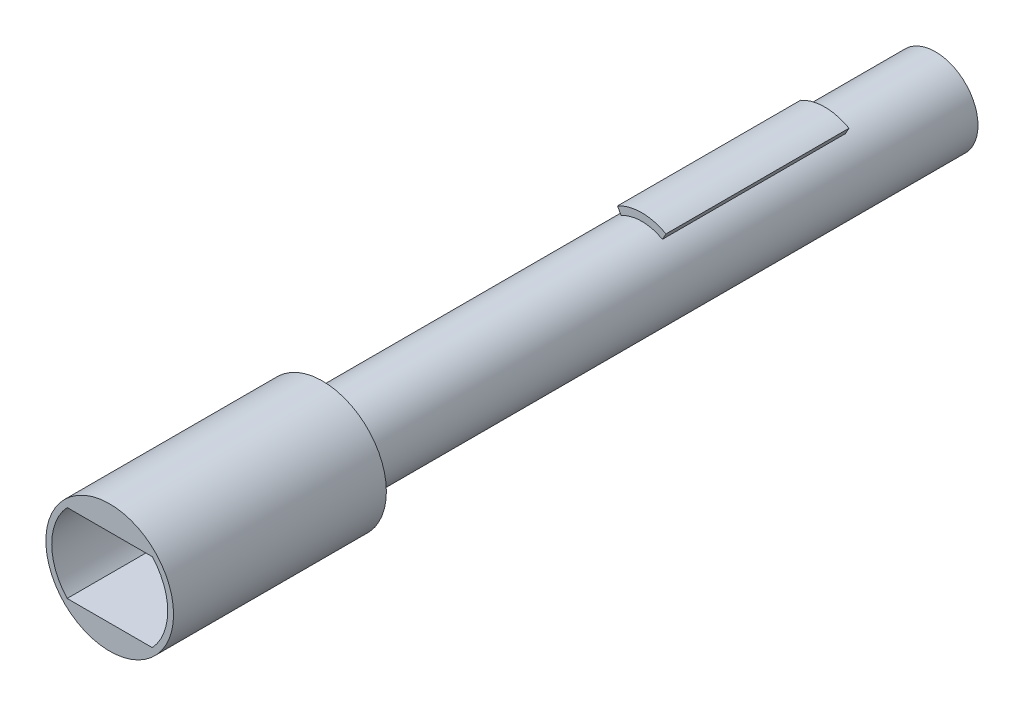
ISO-10303-21;
HEADER;
FILE_DESCRIPTION(('STEP AP214'),'2;1');
FILE_NAME('part.step','',(''),(''),'','','');
FILE_SCHEMA(('AUTOMOTIVE_DESIGN { 1 0 10303 214 1 1 1 1 }'));
ENDSEC;
DATA;
#1=APPLICATION_CONTEXT('core data for automotive mechanical design processes');
#2=APPLICATION_PROTOCOL_DEFINITION('international standard','automotive_design',2000,#1);
#3=PRODUCT_CONTEXT('',#1,'mechanical');
#4=PRODUCT('Part','Part','',(#3));
#5=PRODUCT_RELATED_PRODUCT_CATEGORY('part','',(#4));
#6=PRODUCT_DEFINITION_FORMATION('','',#4);
#7=PRODUCT_DEFINITION_CONTEXT('part definition',#1,'design');
#8=PRODUCT_DEFINITION('design','',#6,#7);
#9=PRODUCT_DEFINITION_SHAPE('','',#8);
#10=(LENGTH_UNIT() NAMED_UNIT(*) SI_UNIT(.MILLI.,.METRE.));
#11=(NAMED_UNIT(*) PLANE_ANGLE_UNIT() SI_UNIT($,.RADIAN.));
#12=(NAMED_UNIT(*) SI_UNIT($,.STERADIAN.) SOLID_ANGLE_UNIT());
#13=UNCERTAINTY_MEASURE_WITH_UNIT(LENGTH_MEASURE(1.E-05),#10,'distance_accuracy_value','');
#14=(GEOMETRIC_REPRESENTATION_CONTEXT(3) GLOBAL_UNCERTAINTY_ASSIGNED_CONTEXT((#13)) GLOBAL_UNIT_ASSIGNED_CONTEXT((#10,
#11,#12)) REPRESENTATION_CONTEXT('',''));
#15=CARTESIAN_POINT('',(0.,0.,0.));
#16=DIRECTION('',(0.,0.,1.));
#17=DIRECTION('',(1.,0.,0.));
#18=AXIS2_PLACEMENT_3D('',#15,#16,#17);
#19=CARTESIAN_POINT('',(0.,0.,5.2));
#20=DIRECTION('',(0.,0.,-1.));
#21=DIRECTION('',(-1.,0.,0.));
#22=AXIS2_PLACEMENT_3D('',#19,#20,#21);
#23=CYLINDRICAL_SURFACE('',#22,2.);
#24=CARTESIAN_POINT('',(0.,0.,5.2));
#25=DIRECTION('',(0.,0.,1.));
#26=DIRECTION('',(1.,0.,0.));
#27=AXIS2_PLACEMENT_3D('',#24,#25,#26);
#28=CIRCLE('',#27,2.);
#29=CARTESIAN_POINT('',(0.969619240492676,1.74923941427879,5.2));
#30=VERTEX_POINT('',#29);
#31=CARTESIAN_POINT('',(-0.969619240492676,1.74923941427879,5.2));
#32=VERTEX_POINT('',#31);
#33=EDGE_CURVE('E12',#30,#32,#28,.T.);
#34=ORIENTED_EDGE('',*,*,#33,.F.);
#35=DIRECTION('',(0.,0.,-1.));
#36=VECTOR('',#35,1.);
#37=CARTESIAN_POINT('',(0.969619240492676,1.74923941427879,13.8));
#38=LINE('',#37,#36);
#39=CARTESIAN_POINT('',(0.969619240492676,1.74923941427879,13.8));
#40=VERTEX_POINT('',#39);
#41=EDGE_CURVE('E204',#40,#30,#38,.T.);
#42=ORIENTED_EDGE('',*,*,#41,.F.);
#43=CARTESIAN_POINT('',(0.,0.,13.8));
#44=DIRECTION('',(0.,0.,1.));
#45=DIRECTION('',(1.,0.,0.));
#46=AXIS2_PLACEMENT_3D('',#43,#44,#45);
#47=CIRCLE('',#46,2.);
#48=CARTESIAN_POINT('',(-0.969619240492676,1.74923941427879,13.8));
#49=VERTEX_POINT('',#48);
#50=EDGE_CURVE('E184',#40,#49,#47,.T.);
#51=ORIENTED_EDGE('',*,*,#50,.T.);
#52=DIRECTION('',(0.,0.,-1.));
#53=VECTOR('',#52,1.);
#54=CARTESIAN_POINT('',(-0.969619240492676,1.74923941427879,13.8));
#55=LINE('',#54,#53);
#56=EDGE_CURVE('E215',#49,#32,#55,.T.);
#57=ORIENTED_EDGE('',*,*,#56,.T.);
#58=EDGE_LOOP('',(#34,#42,#51,#57));
#59=FACE_BOUND('',#58,.T.);
#60=CARTESIAN_POINT('',(0.,0.,0.));
#61=DIRECTION('',(0.,0.,1.));
#62=DIRECTION('',(1.,0.,0.));
#63=AXIS2_PLACEMENT_3D('',#60,#61,#62);
#64=CIRCLE('',#63,2.);
#65=CARTESIAN_POINT('',(2.,0.,0.));
#66=VERTEX_POINT('',#65);
#67=EDGE_CURVE('E68',#66,#66,#64,.T.);
#68=ORIENTED_EDGE('',*,*,#67,.T.);
#69=EDGE_LOOP('',(#68));
#70=FACE_BOUND('',#69,.T.);
#71=CARTESIAN_POINT('',(0.,0.,28.8));
#72=DIRECTION('',(0.,0.,1.));
#73=DIRECTION('',(1.,0.,0.));
#74=AXIS2_PLACEMENT_3D('',#71,#72,#73);
#75=CIRCLE('',#74,2.);
#76=CARTESIAN_POINT('',(2.,0.,28.8));
#77=VERTEX_POINT('',#76);
#78=EDGE_CURVE('E188',#77,#77,#75,.T.);
#79=ORIENTED_EDGE('',*,*,#78,.F.);
#80=EDGE_LOOP('',(#79));
#81=FACE_BOUND('',#80,.T.);
#82=ADVANCED_FACE('F65',(#59,#70,#81),#23,.T.);
#83=CARTESIAN_POINT('',(0.,0.,0.));
#84=DIRECTION('',(0.,0.,1.));
#85=DIRECTION('',(1.,0.,0.));
#86=AXIS2_PLACEMENT_3D('',#83,#84,#85);
#87=PLANE('',#86);
#88=ORIENTED_EDGE('',*,*,#67,.F.);
#89=EDGE_LOOP('',(#88));
#90=FACE_BOUND('',#89,.T.);
#91=ADVANCED_FACE('F248',(#90),#87,.F.);
#92=CARTESIAN_POINT('',(0.,0.,5.2));
#93=DIRECTION('',(0.,0.,1.));
#94=DIRECTION('',(1.,0.,0.));
#95=AXIS2_PLACEMENT_3D('',#92,#93,#94);
#96=PLANE('',#95);
#97=DIRECTION('',(0.484809620246338,0.874619707139395,0.));
#98=VECTOR('',#97,1.);
#99=CARTESIAN_POINT('',(0.,0.,5.2));
#100=LINE('',#99,#98);
#101=CARTESIAN_POINT('',(1.13930260757889,2.05535631177758,5.2));
#102=VERTEX_POINT('',#101);
#103=EDGE_CURVE('E192',#30,#102,#100,.T.);
#104=ORIENTED_EDGE('',*,*,#103,.F.);
#105=ORIENTED_EDGE('',*,*,#33,.T.);
#106=DIRECTION('',(-0.484809620246338,0.874619707139395,0.));
#107=VECTOR('',#106,1.);
#108=CARTESIAN_POINT('',(0.,0.,5.2));
#109=LINE('',#108,#107);
#110=CARTESIAN_POINT('',(-1.13930260757889,2.05535631177758,5.2));
#111=VERTEX_POINT('',#110);
#112=EDGE_CURVE('E200',#32,#111,#109,.T.);
#113=ORIENTED_EDGE('',*,*,#112,.T.);
#114=CARTESIAN_POINT('',(0.,0.,5.2));
#115=DIRECTION('',(0.,0.,1.));
#116=DIRECTION('',(1.,0.,0.));
#117=AXIS2_PLACEMENT_3D('',#114,#115,#116);
#118=CIRCLE('',#117,2.35);
#119=EDGE_CURVE('E205',#102,#111,#118,.T.);
#120=ORIENTED_EDGE('',*,*,#119,.F.);
#121=EDGE_LOOP('',(#104,#105,#113,#120));
#122=FACE_BOUND('',#121,.T.);
#123=ADVANCED_FACE('F237',(#122),#96,.F.);
#124=CARTESIAN_POINT('',(0.,0.,13.8));
#125=DIRECTION('',(-0.874619707139395,-0.484809620246338,0.));
#126=DIRECTION('',(0.484809620246338,-0.874619707139395,0.));
#127=AXIS2_PLACEMENT_3D('',#124,#125,#126);
#128=PLANE('',#127);
#129=ORIENTED_EDGE('',*,*,#112,.F.);
#130=ORIENTED_EDGE('',*,*,#56,.F.);
#131=DIRECTION('',(-0.484809620246338,0.874619707139395,0.));
#132=VECTOR('',#131,1.);
#133=CARTESIAN_POINT('',(0.,0.,13.8));
#134=LINE('',#133,#132);
#135=CARTESIAN_POINT('',(-1.13930260757889,2.05535631177758,13.8));
#136=VERTEX_POINT('',#135);
#137=EDGE_CURVE('E199',#49,#136,#134,.T.);
#138=ORIENTED_EDGE('',*,*,#137,.T.);
#139=DIRECTION('',(0.,0.,-1.));
#140=VECTOR('',#139,1.);
#141=CARTESIAN_POINT('',(-1.13930260757889,2.05535631177758,13.8));
#142=LINE('',#141,#140);
#143=EDGE_CURVE('E218',#136,#111,#142,.T.);
#144=ORIENTED_EDGE('',*,*,#143,.T.);
#145=EDGE_LOOP('',(#129,#130,#138,#144));
#146=FACE_BOUND('',#145,.T.);
#147=ADVANCED_FACE('F240',(#146),#128,.T.);
#148=CARTESIAN_POINT('',(0.,0.,13.8));
#149=DIRECTION('',(0.,0.,-1.));
#150=DIRECTION('',(-1.,0.,0.));
#151=AXIS2_PLACEMENT_3D('',#148,#149,#150);
#152=CYLINDRICAL_SURFACE('',#151,2.35);
#153=ORIENTED_EDGE('',*,*,#119,.T.);
#154=ORIENTED_EDGE('',*,*,#143,.F.);
#155=CARTESIAN_POINT('',(0.,0.,13.8));
#156=DIRECTION('',(0.,0.,1.));
#157=DIRECTION('',(1.,0.,0.));
#158=AXIS2_PLACEMENT_3D('',#155,#156,#157);
#159=CIRCLE('',#158,2.35);
#160=CARTESIAN_POINT('',(1.13930260757889,2.05535631177758,13.8));
#161=VERTEX_POINT('',#160);
#162=EDGE_CURVE('E196',#161,#136,#159,.T.);
#163=ORIENTED_EDGE('',*,*,#162,.F.);
#164=DIRECTION('',(0.,0.,-1.));
#165=VECTOR('',#164,1.);
#166=CARTESIAN_POINT('',(1.13930260757889,2.05535631177758,13.8));
#167=LINE('',#166,#165);
#168=EDGE_CURVE('E209',#161,#102,#167,.T.);
#169=ORIENTED_EDGE('',*,*,#168,.T.);
#170=EDGE_LOOP('',(#153,#154,#163,#169));
#171=FACE_BOUND('',#170,.T.);
#172=ADVANCED_FACE('F232',(#171),#152,.T.);
#173=CARTESIAN_POINT('',(0.,0.,13.8));
#174=DIRECTION('',(0.,0.,1.));
#175=DIRECTION('',(1.,0.,0.));
#176=AXIS2_PLACEMENT_3D('',#173,#174,#175);
#177=PLANE('',#176);
#178=ORIENTED_EDGE('',*,*,#50,.F.);
#179=DIRECTION('',(0.484809620246338,0.874619707139395,0.));
#180=VECTOR('',#179,1.);
#181=CARTESIAN_POINT('',(0.,0.,13.8));
#182=LINE('',#181,#180);
#183=EDGE_CURVE('E221',#40,#161,#182,.T.);
#184=ORIENTED_EDGE('',*,*,#183,.T.);
#185=ORIENTED_EDGE('',*,*,#162,.T.);
#186=ORIENTED_EDGE('',*,*,#137,.F.);
#187=EDGE_LOOP('',(#178,#184,#185,#186));
#188=FACE_BOUND('',#187,.T.);
#189=ADVANCED_FACE('F244',(#188),#177,.T.);
#190=CARTESIAN_POINT('',(0.,0.,13.8));
#191=DIRECTION('',(-0.874619707139395,0.484809620246338,0.));
#192=DIRECTION('',(-0.484809620246338,-0.874619707139395,0.));
#193=AXIS2_PLACEMENT_3D('',#190,#191,#192);
#194=PLANE('',#193);
#195=ORIENTED_EDGE('',*,*,#183,.F.);
#196=ORIENTED_EDGE('',*,*,#41,.T.);
#197=ORIENTED_EDGE('',*,*,#103,.T.);
#198=ORIENTED_EDGE('',*,*,#168,.F.);
#199=EDGE_LOOP('',(#195,#196,#197,#198));
#200=FACE_BOUND('',#199,.T.);
#201=ADVANCED_FACE('F235',(#200),#194,.F.);
#202=CARTESIAN_POINT('',(0.,0.,38.8));
#203=DIRECTION('',(0.,0.,-1.));
#204=DIRECTION('',(-1.,0.,0.));
#205=AXIS2_PLACEMENT_3D('',#202,#203,#204);
#206=CYLINDRICAL_SURFACE('',#205,3.);
#207=CARTESIAN_POINT('',(0.,0.,38.8));
#208=DIRECTION('',(0.,0.,1.));
#209=DIRECTION('',(1.,0.,0.));
#210=AXIS2_PLACEMENT_3D('',#207,#208,#209);
#211=CIRCLE('',#210,3.);
#212=CARTESIAN_POINT('',(3.,0.,38.8));
#213=VERTEX_POINT('',#212);
#214=EDGE_CURVE('E180',#213,#213,#211,.T.);
#215=ORIENTED_EDGE('',*,*,#214,.F.);
#216=EDGE_LOOP('',(#215));
#217=FACE_BOUND('',#216,.T.);
#218=CARTESIAN_POINT('',(0.,0.,28.8));
#219=DIRECTION('',(0.,0.,1.));
#220=DIRECTION('',(1.,0.,0.));
#221=AXIS2_PLACEMENT_3D('',#218,#219,#220);
#222=CIRCLE('',#221,3.);
#223=CARTESIAN_POINT('',(3.,0.,28.8));
#224=VERTEX_POINT('',#223);
#225=EDGE_CURVE('E174',#224,#224,#222,.T.);
#226=ORIENTED_EDGE('',*,*,#225,.T.);
#227=EDGE_LOOP('',(#226));
#228=FACE_BOUND('',#227,.T.);
#229=ADVANCED_FACE('F261',(#217,#228),#206,.T.);
#230=CARTESIAN_POINT('',(0.,0.,38.8));
#231=DIRECTION('',(0.,0.,1.));
#232=DIRECTION('',(1.,0.,0.));
#233=AXIS2_PLACEMENT_3D('',#230,#231,#232);
#234=PLANE('',#233);
#235=CARTESIAN_POINT('',(0.,0.,38.8));
#236=DIRECTION('',(0.,0.,1.));
#237=DIRECTION('',(1.,0.,0.));
#238=AXIS2_PLACEMENT_3D('',#235,#236,#237);
#239=CIRCLE('',#238,2.725);
#240=CARTESIAN_POINT('',(2.00078109747168,-1.85,38.8));
#241=VERTEX_POINT('',#240);
#242=CARTESIAN_POINT('',(2.00078109747168,1.85,38.8));
#243=VERTEX_POINT('',#242);
#244=EDGE_CURVE('E80',#241,#243,#239,.T.);
#245=ORIENTED_EDGE('',*,*,#244,.F.);
#246=DIRECTION('',(1.,0.,0.));
#247=VECTOR('',#246,1.);
#248=CARTESIAN_POINT('',(2.00078109747168,-1.85,38.8));
#249=LINE('',#248,#247);
#250=CARTESIAN_POINT('',(-2.00078109747169,-1.85,38.8));
#251=VERTEX_POINT('',#250);
#252=EDGE_CURVE('E152',#251,#241,#249,.T.);
#253=ORIENTED_EDGE('',*,*,#252,.F.);
#254=CARTESIAN_POINT('',(0.,0.,38.8));
#255=DIRECTION('',(0.,0.,1.));
#256=DIRECTION('',(1.,0.,0.));
#257=AXIS2_PLACEMENT_3D('',#254,#255,#256);
#258=CIRCLE('',#257,2.725);
#259=CARTESIAN_POINT('',(-2.00078109747168,1.85,38.8));
#260=VERTEX_POINT('',#259);
#261=EDGE_CURVE('E156',#260,#251,#258,.T.);
#262=ORIENTED_EDGE('',*,*,#261,.F.);
#263=DIRECTION('',(-1.,0.,0.));
#264=VECTOR('',#263,1.);
#265=CARTESIAN_POINT('',(2.00078109747168,1.85,38.8));
#266=LINE('',#265,#264);
#267=EDGE_CURVE('E165',#243,#260,#266,.T.);
#268=ORIENTED_EDGE('',*,*,#267,.F.);
#269=EDGE_LOOP('',(#245,#253,#262,#268));
#270=FACE_BOUND('',#269,.T.);
#271=ORIENTED_EDGE('',*,*,#214,.T.);
#272=EDGE_LOOP('',(#271));
#273=FACE_BOUND('',#272,.T.);
#274=ADVANCED_FACE('F257',(#270,#273),#234,.T.);
#275=CARTESIAN_POINT('',(0.,0.,28.8));
#276=DIRECTION('',(0.,0.,1.));
#277=DIRECTION('',(1.,0.,0.));
#278=AXIS2_PLACEMENT_3D('',#275,#276,#277);
#279=PLANE('',#278);
#280=ORIENTED_EDGE('',*,*,#78,.T.);
#281=EDGE_LOOP('',(#280));
#282=FACE_BOUND('',#281,.T.);
#283=ORIENTED_EDGE('',*,*,#225,.F.);
#284=EDGE_LOOP('',(#283));
#285=FACE_BOUND('',#284,.T.);
#286=ADVANCED_FACE('F254',(#282,#285),#279,.F.);
#287=CARTESIAN_POINT('',(0.,0.,30.8));
#288=DIRECTION('',(0.,0.,1.));
#289=DIRECTION('',(1.,0.,0.));
#290=AXIS2_PLACEMENT_3D('',#287,#288,#289);
#291=CYLINDRICAL_SURFACE('',#290,2.725);
#292=ORIENTED_EDGE('',*,*,#244,.T.);
#293=DIRECTION('',(0.,0.,1.));
#294=VECTOR('',#293,1.);
#295=CARTESIAN_POINT('',(2.00078109747168,1.85,30.8));
#296=LINE('',#295,#294);
#297=CARTESIAN_POINT('',(2.00078109747168,1.85,30.8));
#298=VERTEX_POINT('',#297);
#299=EDGE_CURVE('E127',#298,#243,#296,.T.);
#300=ORIENTED_EDGE('',*,*,#299,.F.);
#301=CARTESIAN_POINT('',(0.,0.,30.8));
#302=DIRECTION('',(0.,0.,1.));
#303=DIRECTION('',(1.,0.,0.));
#304=AXIS2_PLACEMENT_3D('',#301,#302,#303);
#305=CIRCLE('',#304,2.725);
#306=CARTESIAN_POINT('',(2.00078109747168,-1.85,30.8));
#307=VERTEX_POINT('',#306);
#308=EDGE_CURVE('E131',#307,#298,#305,.T.);
#309=ORIENTED_EDGE('',*,*,#308,.F.);
#310=DIRECTION('',(0.,0.,1.));
#311=VECTOR('',#310,1.);
#312=CARTESIAN_POINT('',(2.00078109747168,-1.85,30.8));
#313=LINE('',#312,#311);
#314=EDGE_CURVE('E171',#307,#241,#313,.T.);
#315=ORIENTED_EDGE('',*,*,#314,.T.);
#316=EDGE_LOOP('',(#292,#300,#309,#315));
#317=FACE_BOUND('',#316,.T.);
#318=ADVANCED_FACE('F129',(#317),#291,.F.);
#319=CARTESIAN_POINT('',(2.00078109747168,-1.85,30.8));
#320=DIRECTION('',(0.,-1.,0.));
#321=DIRECTION('',(0.,0.,-1.));
#322=AXIS2_PLACEMENT_3D('',#319,#320,#321);
#323=PLANE('',#322);
#324=ORIENTED_EDGE('',*,*,#252,.T.);
#325=ORIENTED_EDGE('',*,*,#314,.F.);
#326=DIRECTION('',(1.,0.,0.));
#327=VECTOR('',#326,1.);
#328=CARTESIAN_POINT('',(2.00078109747168,-1.85,30.8));
#329=LINE('',#328,#327);
#330=CARTESIAN_POINT('',(-2.00078109747169,-1.85,30.8));
#331=VERTEX_POINT('',#330);
#332=EDGE_CURVE('E138',#331,#307,#329,.T.);
#333=ORIENTED_EDGE('',*,*,#332,.F.);
#334=DIRECTION('',(0.,0.,1.));
#335=VECTOR('',#334,1.);
#336=CARTESIAN_POINT('',(-2.00078109747169,-1.85,30.8));
#337=LINE('',#336,#335);
#338=EDGE_CURVE('E175',#331,#251,#337,.T.);
#339=ORIENTED_EDGE('',*,*,#338,.T.);
#340=EDGE_LOOP('',(#324,#325,#333,#339));
#341=FACE_BOUND('',#340,.T.);
#342=ADVANCED_FACE('F341',(#341),#323,.F.);
#343=CARTESIAN_POINT('',(0.,0.,30.8));
#344=DIRECTION('',(0.,0.,1.));
#345=DIRECTION('',(1.,0.,0.));
#346=AXIS2_PLACEMENT_3D('',#343,#344,#345);
#347=CYLINDRICAL_SURFACE('',#346,2.725);
#348=ORIENTED_EDGE('',*,*,#261,.T.);
#349=ORIENTED_EDGE('',*,*,#338,.F.);
#350=CARTESIAN_POINT('',(0.,0.,30.8));
#351=DIRECTION('',(0.,0.,1.));
#352=DIRECTION('',(1.,0.,0.));
#353=AXIS2_PLACEMENT_3D('',#350,#351,#352);
#354=CIRCLE('',#353,2.725);
#355=CARTESIAN_POINT('',(-2.00078109747168,1.85,30.8));
#356=VERTEX_POINT('',#355);
#357=EDGE_CURVE('E147',#356,#331,#354,.T.);
#358=ORIENTED_EDGE('',*,*,#357,.F.);
#359=DIRECTION('',(0.,0.,1.));
#360=VECTOR('',#359,1.);
#361=CARTESIAN_POINT('',(-2.00078109747168,1.85,30.8));
#362=LINE('',#361,#360);
#363=EDGE_CURVE('E137',#356,#260,#362,.T.);
#364=ORIENTED_EDGE('',*,*,#363,.T.);
#365=EDGE_LOOP('',(#348,#349,#358,#364));
#366=FACE_BOUND('',#365,.T.);
#367=ADVANCED_FACE('F349',(#366),#347,.F.);
#368=CARTESIAN_POINT('',(2.00078109747168,1.85,30.8));
#369=DIRECTION('',(0.,1.,0.));
#370=DIRECTION('',(0.,0.,1.));
#371=AXIS2_PLACEMENT_3D('',#368,#369,#370);
#372=PLANE('',#371);
#373=ORIENTED_EDGE('',*,*,#267,.T.);
#374=ORIENTED_EDGE('',*,*,#363,.F.);
#375=DIRECTION('',(-1.,0.,0.));
#376=VECTOR('',#375,1.);
#377=CARTESIAN_POINT('',(2.00078109747168,1.85,30.8));
#378=LINE('',#377,#376);
#379=EDGE_CURVE('E141',#298,#356,#378,.T.);
#380=ORIENTED_EDGE('',*,*,#379,.F.);
#381=ORIENTED_EDGE('',*,*,#299,.T.);
#382=EDGE_LOOP('',(#373,#374,#380,#381));
#383=FACE_BOUND('',#382,.T.);
#384=ADVANCED_FACE('F142',(#383),#372,.F.);
#385=CARTESIAN_POINT('',(0.,0.,30.8));
#386=DIRECTION('',(0.,0.,1.));
#387=DIRECTION('',(1.,0.,0.));
#388=AXIS2_PLACEMENT_3D('',#385,#386,#387);
#389=PLANE('',#388);
#390=ORIENTED_EDGE('',*,*,#308,.T.);
#391=ORIENTED_EDGE('',*,*,#379,.T.);
#392=ORIENTED_EDGE('',*,*,#357,.T.);
#393=ORIENTED_EDGE('',*,*,#332,.T.);
#394=EDGE_LOOP('',(#390,#391,#392,#393));
#395=FACE_BOUND('',#394,.T.);
#396=ADVANCED_FACE('F149',(#395),#389,.T.);
#397=CLOSED_SHELL('',(#82,#91,#123,#147,#172,#189,#201,#229,#274,#286,#318,#342,#367,#384,#396));
#398=MANIFOLD_SOLID_BREP('B2',#397);
#399=ADVANCED_BREP_SHAPE_REPRESENTATION('',(#18,#398),#14);
#400=SHAPE_DEFINITION_REPRESENTATION(#9,#399);
ENDSEC;
END-ISO-10303-21;
